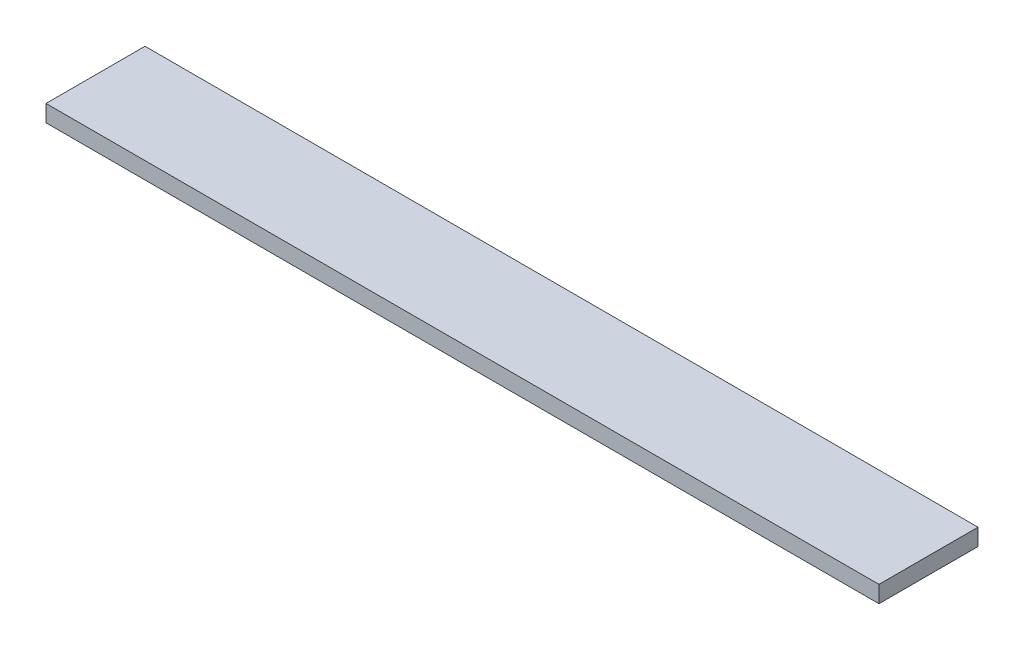
ISO-10303-21;
HEADER;
FILE_DESCRIPTION(('STEP AP214'),'2;1');
FILE_NAME('part.step','',(''),(''),'','','');
FILE_SCHEMA(('AUTOMOTIVE_DESIGN { 1 0 10303 214 1 1 1 1 }'));
ENDSEC;
DATA;
#1=APPLICATION_CONTEXT('core data for automotive mechanical design processes');
#2=APPLICATION_PROTOCOL_DEFINITION('international standard','automotive_design',2000,#1);
#3=PRODUCT_CONTEXT('',#1,'mechanical');
#4=PRODUCT('Part','Part','',(#3));
#5=PRODUCT_RELATED_PRODUCT_CATEGORY('part','',(#4));
#6=PRODUCT_DEFINITION_FORMATION('','',#4);
#7=PRODUCT_DEFINITION_CONTEXT('part definition',#1,'design');
#8=PRODUCT_DEFINITION('design','',#6,#7);
#9=PRODUCT_DEFINITION_SHAPE('','',#8);
#10=(LENGTH_UNIT() NAMED_UNIT(*) SI_UNIT(.MILLI.,.METRE.));
#11=(NAMED_UNIT(*) PLANE_ANGLE_UNIT() SI_UNIT($,.RADIAN.));
#12=(NAMED_UNIT(*) SI_UNIT($,.STERADIAN.) SOLID_ANGLE_UNIT());
#13=UNCERTAINTY_MEASURE_WITH_UNIT(LENGTH_MEASURE(1.E-05),#10,'distance_accuracy_value','');
#14=(GEOMETRIC_REPRESENTATION_CONTEXT(3) GLOBAL_UNCERTAINTY_ASSIGNED_CONTEXT((#13)) GLOBAL_UNIT_ASSIGNED_CONTEXT((#10,
#11,#12)) REPRESENTATION_CONTEXT('',''));
#15=CARTESIAN_POINT('',(0.,0.,0.));
#16=DIRECTION('',(0.,0.,1.));
#17=DIRECTION('',(1.,0.,0.));
#18=AXIS2_PLACEMENT_3D('',#15,#16,#17);
#19=CARTESIAN_POINT('',(-123.010990338164,-10.,-24.2309178743961));
#20=DIRECTION('',(-1.,0.,0.));
#21=DIRECTION('',(0.,0.,1.));
#22=AXIS2_PLACEMENT_3D('',#19,#20,#21);
#23=PLANE('',#22);
#24=DIRECTION('',(0.,0.,1.));
#25=VECTOR('',#24,1.);
#26=CARTESIAN_POINT('',(-123.010990338164,0.,-24.2309178743961));
#27=LINE('',#26,#25);
#28=CARTESIAN_POINT('',(-123.010990338164,0.,-24.2309178743961));
#29=VERTEX_POINT('',#28);
#30=CARTESIAN_POINT('',(-123.010990338164,0.,34.7830917874396));
#31=VERTEX_POINT('',#30);
#32=EDGE_CURVE('E74',#29,#31,#27,.T.);
#33=ORIENTED_EDGE('',*,*,#32,.F.);
#34=DIRECTION('',(0.,1.,0.));
#35=VECTOR('',#34,1.);
#36=CARTESIAN_POINT('',(-123.010990338164,-10.,-24.2309178743961));
#37=LINE('',#36,#35);
#38=CARTESIAN_POINT('',(-123.010990338164,-10.,-24.2309178743961));
#39=VERTEX_POINT('',#38);
#40=EDGE_CURVE('E11',#39,#29,#37,.T.);
#41=ORIENTED_EDGE('',*,*,#40,.F.);
#42=DIRECTION('',(0.,0.,1.));
#43=VECTOR('',#42,1.);
#44=CARTESIAN_POINT('',(-123.010990338164,-10.,-24.2309178743961));
#45=LINE('',#44,#43);
#46=CARTESIAN_POINT('',(-123.010990338164,-10.,34.7830917874396));
#47=VERTEX_POINT('',#46);
#48=EDGE_CURVE('E76',#39,#47,#45,.T.);
#49=ORIENTED_EDGE('',*,*,#48,.T.);
#50=DIRECTION('',(0.,1.,0.));
#51=VECTOR('',#50,1.);
#52=CARTESIAN_POINT('',(-123.010990338164,-10.,34.7830917874396));
#53=LINE('',#52,#51);
#54=EDGE_CURVE('E37',#47,#31,#53,.T.);
#55=ORIENTED_EDGE('',*,*,#54,.T.);
#56=EDGE_LOOP('',(#33,#41,#49,#55));
#57=FACE_BOUND('',#56,.T.);
#58=ADVANCED_FACE('F34',(#57),#23,.T.);
#59=CARTESIAN_POINT('',(-123.010990338164,-10.,-24.2309178743961));
#60=DIRECTION('',(0.,0.,-1.));
#61=DIRECTION('',(-1.,0.,0.));
#62=AXIS2_PLACEMENT_3D('',#59,#60,#61);
#63=PLANE('',#62);
#64=DIRECTION('',(-1.,0.,0.));
#65=VECTOR('',#64,1.);
#66=CARTESIAN_POINT('',(-123.010990338164,0.,-24.2309178743961));
#67=LINE('',#66,#65);
#68=CARTESIAN_POINT('',(373.356746779422,0.,-24.2309178743961));
#69=VERTEX_POINT('',#68);
#70=EDGE_CURVE('E91',#69,#29,#67,.T.);
#71=ORIENTED_EDGE('',*,*,#70,.F.);
#72=DIRECTION('',(0.,1.,0.));
#73=VECTOR('',#72,1.);
#74=CARTESIAN_POINT('',(373.356746779422,-10.,-24.2309178743961));
#75=LINE('',#74,#73);
#76=CARTESIAN_POINT('',(373.356746779422,-10.,-24.2309178743961));
#77=VERTEX_POINT('',#76);
#78=EDGE_CURVE('E42',#77,#69,#75,.T.);
#79=ORIENTED_EDGE('',*,*,#78,.F.);
#80=DIRECTION('',(-1.,0.,0.));
#81=VECTOR('',#80,1.);
#82=CARTESIAN_POINT('',(-123.010990338164,-10.,-24.2309178743961));
#83=LINE('',#82,#81);
#84=EDGE_CURVE('E81',#77,#39,#83,.T.);
#85=ORIENTED_EDGE('',*,*,#84,.T.);
#86=ORIENTED_EDGE('',*,*,#40,.T.);
#87=EDGE_LOOP('',(#71,#79,#85,#86));
#88=FACE_BOUND('',#87,.T.);
#89=ADVANCED_FACE('F106',(#88),#63,.T.);
#90=CARTESIAN_POINT('',(373.356746779422,-10.,-24.2309178743961));
#91=DIRECTION('',(1.,0.,0.));
#92=DIRECTION('',(0.,0.,-1.));
#93=AXIS2_PLACEMENT_3D('',#90,#91,#92);
#94=PLANE('',#93);
#95=DIRECTION('',(0.,0.,-1.));
#96=VECTOR('',#95,1.);
#97=CARTESIAN_POINT('',(373.356746779422,0.,-24.2309178743961));
#98=LINE('',#97,#96);
#99=CARTESIAN_POINT('',(373.356746779422,0.,34.7830917874396));
#100=VERTEX_POINT('',#99);
#101=EDGE_CURVE('E88',#100,#69,#98,.T.);
#102=ORIENTED_EDGE('',*,*,#101,.F.);
#103=DIRECTION('',(0.,1.,0.));
#104=VECTOR('',#103,1.);
#105=CARTESIAN_POINT('',(373.356746779422,-10.,34.7830917874396));
#106=LINE('',#105,#104);
#107=CARTESIAN_POINT('',(373.356746779422,-10.,34.7830917874396));
#108=VERTEX_POINT('',#107);
#109=EDGE_CURVE('E80',#108,#100,#106,.T.);
#110=ORIENTED_EDGE('',*,*,#109,.F.);
#111=DIRECTION('',(0.,0.,-1.));
#112=VECTOR('',#111,1.);
#113=CARTESIAN_POINT('',(373.356746779422,-10.,-24.2309178743961));
#114=LINE('',#113,#112);
#115=EDGE_CURVE('E99',#108,#77,#114,.T.);
#116=ORIENTED_EDGE('',*,*,#115,.T.);
#117=ORIENTED_EDGE('',*,*,#78,.T.);
#118=EDGE_LOOP('',(#102,#110,#116,#117));
#119=FACE_BOUND('',#118,.T.);
#120=ADVANCED_FACE('F103',(#119),#94,.T.);
#121=CARTESIAN_POINT('',(-123.010990338164,-10.,34.7830917874396));
#122=DIRECTION('',(0.,0.,1.));
#123=DIRECTION('',(1.,0.,0.));
#124=AXIS2_PLACEMENT_3D('',#121,#122,#123);
#125=PLANE('',#124);
#126=DIRECTION('',(1.,0.,0.));
#127=VECTOR('',#126,1.);
#128=CARTESIAN_POINT('',(-123.010990338164,0.,34.7830917874396));
#129=LINE('',#128,#127);
#130=EDGE_CURVE('E83',#31,#100,#129,.T.);
#131=ORIENTED_EDGE('',*,*,#130,.F.);
#132=ORIENTED_EDGE('',*,*,#54,.F.);
#133=DIRECTION('',(1.,0.,0.));
#134=VECTOR('',#133,1.);
#135=CARTESIAN_POINT('',(-123.010990338164,-10.,34.7830917874396));
#136=LINE('',#135,#134);
#137=EDGE_CURVE('E97',#47,#108,#136,.T.);
#138=ORIENTED_EDGE('',*,*,#137,.T.);
#139=ORIENTED_EDGE('',*,*,#109,.T.);
#140=EDGE_LOOP('',(#131,#132,#138,#139));
#141=FACE_BOUND('',#140,.T.);
#142=ADVANCED_FACE('F84',(#141),#125,.T.);
#143=CARTESIAN_POINT('',(-123.010990338164,-10.,34.7830917874396));
#144=DIRECTION('',(0.,1.,0.));
#145=DIRECTION('',(0.,0.,1.));
#146=AXIS2_PLACEMENT_3D('',#143,#144,#145);
#147=PLANE('',#146);
#148=ORIENTED_EDGE('',*,*,#48,.F.);
#149=ORIENTED_EDGE('',*,*,#84,.F.);
#150=ORIENTED_EDGE('',*,*,#115,.F.);
#151=ORIENTED_EDGE('',*,*,#137,.F.);
#152=EDGE_LOOP('',(#148,#149,#150,#151));
#153=FACE_BOUND('',#152,.T.);
#154=ADVANCED_FACE('F108',(#153),#147,.F.);
#155=CARTESIAN_POINT('',(-123.010990338164,0.,34.7830917874396));
#156=DIRECTION('',(0.,1.,0.));
#157=DIRECTION('',(0.,0.,1.));
#158=AXIS2_PLACEMENT_3D('',#155,#156,#157);
#159=PLANE('',#158);
#160=ORIENTED_EDGE('',*,*,#32,.T.);
#161=ORIENTED_EDGE('',*,*,#130,.T.);
#162=ORIENTED_EDGE('',*,*,#101,.T.);
#163=ORIENTED_EDGE('',*,*,#70,.T.);
#164=EDGE_LOOP('',(#160,#161,#162,#163));
#165=FACE_BOUND('',#164,.T.);
#166=ADVANCED_FACE('F90',(#165),#159,.T.);
#167=CLOSED_SHELL('',(#58,#89,#120,#142,#154,#166));
#168=MANIFOLD_SOLID_BREP('B2',#167);
#169=ADVANCED_BREP_SHAPE_REPRESENTATION('',(#18,#168),#14);
#170=SHAPE_DEFINITION_REPRESENTATION(#9,#169);
ENDSEC;
END-ISO-10303-21;
